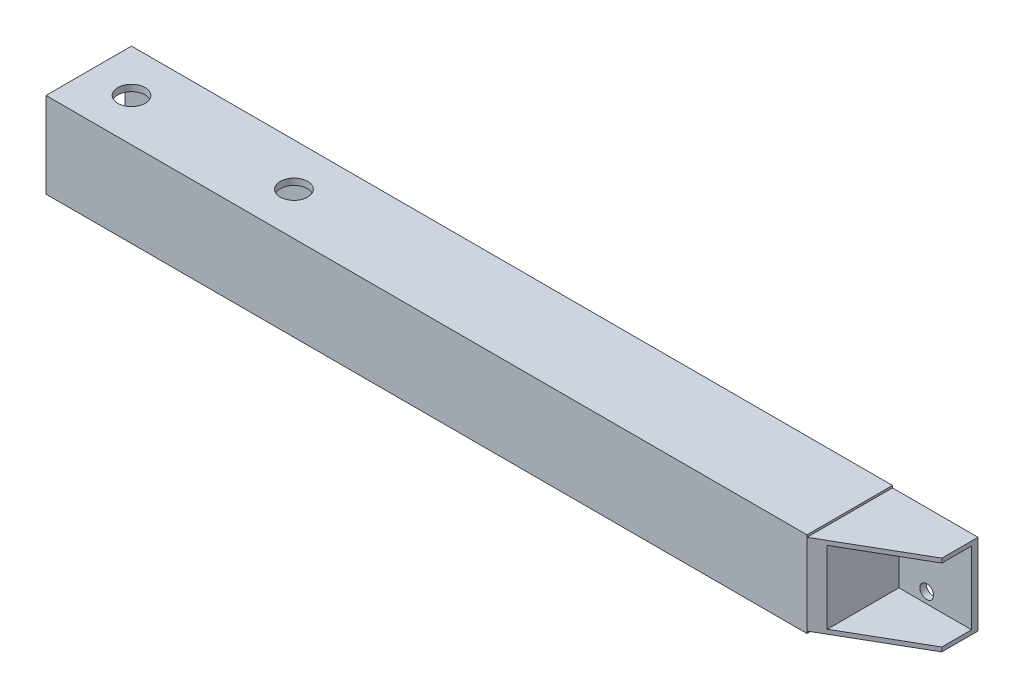
ISO-10303-21;
HEADER;
FILE_DESCRIPTION(('STEP AP214'),'2;1');
FILE_NAME('part.step','',(''),(''),'','','');
FILE_SCHEMA(('AUTOMOTIVE_DESIGN { 1 0 10303 214 1 1 1 1 }'));
ENDSEC;
DATA;
#1=APPLICATION_CONTEXT('core data for automotive mechanical design processes');
#2=APPLICATION_PROTOCOL_DEFINITION('international standard','automotive_design',2000,#1);
#3=PRODUCT_CONTEXT('',#1,'mechanical');
#4=PRODUCT('Part','Part','',(#3));
#5=PRODUCT_RELATED_PRODUCT_CATEGORY('part','',(#4));
#6=PRODUCT_DEFINITION_FORMATION('','',#4);
#7=PRODUCT_DEFINITION_CONTEXT('part definition',#1,'design');
#8=PRODUCT_DEFINITION('design','',#6,#7);
#9=PRODUCT_DEFINITION_SHAPE('','',#8);
#10=(LENGTH_UNIT() NAMED_UNIT(*) SI_UNIT(.MILLI.,.METRE.));
#11=(NAMED_UNIT(*) PLANE_ANGLE_UNIT() SI_UNIT($,.RADIAN.));
#12=(NAMED_UNIT(*) SI_UNIT($,.STERADIAN.) SOLID_ANGLE_UNIT());
#13=UNCERTAINTY_MEASURE_WITH_UNIT(LENGTH_MEASURE(1.E-05),#10,'distance_accuracy_value','');
#14=(GEOMETRIC_REPRESENTATION_CONTEXT(3) GLOBAL_UNCERTAINTY_ASSIGNED_CONTEXT((#13)) GLOBAL_UNIT_ASSIGNED_CONTEXT((#10,
#11,#12)) REPRESENTATION_CONTEXT('',''));
#15=CARTESIAN_POINT('',(0.,0.,0.));
#16=DIRECTION('',(0.,0.,1.));
#17=DIRECTION('',(1.,0.,0.));
#18=AXIS2_PLACEMENT_3D('',#15,#16,#17);
#19=CARTESIAN_POINT('',(0.,0.,0.));
#20=DIRECTION('',(0.,0.,1.));
#21=DIRECTION('',(1.,0.,0.));
#22=AXIS2_PLACEMENT_3D('',#19,#20,#21);
#23=PLANE('',#22);
#24=CARTESIAN_POINT('',(98.5,-6.,0.));
#25=DIRECTION('',(0.,0.,-1.));
#26=DIRECTION('',(1.,0.,0.));
#27=AXIS2_PLACEMENT_3D('',#24,#25,#26);
#28=CIRCLE('',#27,1.60000000000001);
#29=CARTESIAN_POINT('',(100.1,-6.,0.));
#30=VERTEX_POINT('',#29);
#31=EDGE_CURVE('E286',#30,#30,#28,.T.);
#32=ORIENTED_EDGE('',*,*,#31,.F.);
#33=EDGE_LOOP('',(#32));
#34=FACE_BOUND('',#33,.T.);
#35=CARTESIAN_POINT('',(98.5,6.,0.));
#36=DIRECTION('',(0.,0.,-1.));
#37=DIRECTION('',(-1.,0.,0.));
#38=AXIS2_PLACEMENT_3D('',#35,#36,#37);
#39=CIRCLE('',#38,1.60000000000001);
#40=CARTESIAN_POINT('',(96.9,6.,0.));
#41=VERTEX_POINT('',#40);
#42=EDGE_CURVE('E283',#41,#41,#39,.T.);
#43=ORIENTED_EDGE('',*,*,#42,.F.);
#44=EDGE_LOOP('',(#43));
#45=FACE_BOUND('',#44,.T.);
#46=DIRECTION('',(0.,-1.,0.));
#47=VECTOR('',#46,1.);
#48=CARTESIAN_POINT('',(89.,0.,0.));
#49=LINE('',#48,#47);
#50=CARTESIAN_POINT('',(89.,-9.5,0.));
#51=VERTEX_POINT('',#50);
#52=CARTESIAN_POINT('',(89.,-10.,0.));
#53=VERTEX_POINT('',#52);
#54=EDGE_CURVE('E156',#51,#53,#49,.T.);
#55=ORIENTED_EDGE('',*,*,#54,.T.);
#56=DIRECTION('',(1.,0.,0.));
#57=VECTOR('',#56,1.);
#58=CARTESIAN_POINT('',(0.,-10.,0.));
#59=LINE('',#58,#57);
#60=CARTESIAN_POINT('',(-89.,-10.,0.));
#61=VERTEX_POINT('',#60);
#62=EDGE_CURVE('E244',#61,#53,#59,.T.);
#63=ORIENTED_EDGE('',*,*,#62,.F.);
#64=DIRECTION('',(0.,1.,0.));
#65=VECTOR('',#64,1.);
#66=CARTESIAN_POINT('',(-89.,0.,0.));
#67=LINE('',#66,#65);
#68=CARTESIAN_POINT('',(-89.,10.,0.));
#69=VERTEX_POINT('',#68);
#70=EDGE_CURVE('E249',#61,#69,#67,.T.);
#71=ORIENTED_EDGE('',*,*,#70,.T.);
#72=DIRECTION('',(1.,0.,0.));
#73=VECTOR('',#72,1.);
#74=CARTESIAN_POINT('',(0.,10.,0.));
#75=LINE('',#74,#73);
#76=CARTESIAN_POINT('',(89.,10.,0.));
#77=VERTEX_POINT('',#76);
#78=EDGE_CURVE('E258',#69,#77,#75,.T.);
#79=ORIENTED_EDGE('',*,*,#78,.T.);
#80=DIRECTION('',(0.,-1.,0.));
#81=VECTOR('',#80,1.);
#82=CARTESIAN_POINT('',(89.,0.,0.));
#83=LINE('',#82,#81);
#84=CARTESIAN_POINT('',(89.,9.5,0.));
#85=VERTEX_POINT('',#84);
#86=EDGE_CURVE('E173',#77,#85,#83,.T.);
#87=ORIENTED_EDGE('',*,*,#86,.T.);
#88=DIRECTION('',(-1.,0.,0.));
#89=VECTOR('',#88,1.);
#90=CARTESIAN_POINT('',(0.,9.5,0.));
#91=LINE('',#90,#89);
#92=CARTESIAN_POINT('',(109.,9.5,0.));
#93=VERTEX_POINT('',#92);
#94=EDGE_CURVE('E177',#93,#85,#91,.T.);
#95=ORIENTED_EDGE('',*,*,#94,.F.);
#96=DIRECTION('',(0.,-1.,0.));
#97=VECTOR('',#96,1.);
#98=CARTESIAN_POINT('',(109.,0.,0.));
#99=LINE('',#98,#97);
#100=CARTESIAN_POINT('',(109.,-9.5,0.));
#101=VERTEX_POINT('',#100);
#102=EDGE_CURVE('E168',#93,#101,#99,.T.);
#103=ORIENTED_EDGE('',*,*,#102,.T.);
#104=DIRECTION('',(-1.,0.,0.));
#105=VECTOR('',#104,1.);
#106=CARTESIAN_POINT('',(0.,-9.5,0.));
#107=LINE('',#106,#105);
#108=EDGE_CURVE('E152',#101,#51,#107,.T.);
#109=ORIENTED_EDGE('',*,*,#108,.T.);
#110=EDGE_LOOP('',(#55,#63,#71,#79,#87,#95,#103,#109));
#111=FACE_BOUND('',#110,.T.);
#112=ADVANCED_FACE('F34',(#34,#45,#111),#23,.F.);
#113=CARTESIAN_POINT('',(0.,-10.,20.));
#114=DIRECTION('',(0.,1.,0.));
#115=DIRECTION('',(0.,0.,1.));
#116=AXIS2_PLACEMENT_3D('',#113,#114,#115);
#117=PLANE('',#116);
#118=CARTESIAN_POINT('',(-41.,-10.,10.));
#119=DIRECTION('',(0.,-1.,0.));
#120=DIRECTION('',(0.,0.,-1.));
#121=AXIS2_PLACEMENT_3D('',#118,#119,#120);
#122=CIRCLE('',#121,3.2);
#123=CARTESIAN_POINT('',(-41.,-10.,6.8));
#124=VERTEX_POINT('',#123);
#125=EDGE_CURVE('E608',#124,#124,#122,.T.);
#126=ORIENTED_EDGE('',*,*,#125,.F.);
#127=EDGE_LOOP('',(#126));
#128=FACE_BOUND('',#127,.T.);
#129=CARTESIAN_POINT('',(-79.,-10.,10.));
#130=DIRECTION('',(0.,-1.,0.));
#131=DIRECTION('',(0.,0.,-1.));
#132=AXIS2_PLACEMENT_3D('',#129,#130,#131);
#133=CIRCLE('',#132,3.2);
#134=CARTESIAN_POINT('',(-79.,-10.,6.8));
#135=VERTEX_POINT('',#134);
#136=EDGE_CURVE('E290',#135,#135,#133,.T.);
#137=ORIENTED_EDGE('',*,*,#136,.F.);
#138=EDGE_LOOP('',(#137));
#139=FACE_BOUND('',#138,.T.);
#140=DIRECTION('',(0.,0.,-1.));
#141=VECTOR('',#140,1.);
#142=CARTESIAN_POINT('',(89.,-10.,24.));
#143=LINE('',#142,#141);
#144=CARTESIAN_POINT('',(89.,-10.,19.9999999999999));
#145=VERTEX_POINT('',#144);
#146=EDGE_CURVE('E159',#145,#53,#143,.T.);
#147=ORIENTED_EDGE('',*,*,#146,.F.);
#148=DIRECTION('',(1.,0.,0.));
#149=VECTOR('',#148,1.);
#150=CARTESIAN_POINT('',(0.,-10.,20.));
#151=LINE('',#150,#149);
#152=CARTESIAN_POINT('',(-89.,-10.,20.));
#153=VERTEX_POINT('',#152);
#154=EDGE_CURVE('E245',#153,#145,#151,.T.);
#155=ORIENTED_EDGE('',*,*,#154,.F.);
#156=DIRECTION('',(0.,0.,-1.));
#157=VECTOR('',#156,1.);
#158=CARTESIAN_POINT('',(-89.,-10.,20.));
#159=LINE('',#158,#157);
#160=EDGE_CURVE('E255',#153,#61,#159,.T.);
#161=ORIENTED_EDGE('',*,*,#160,.T.);
#162=ORIENTED_EDGE('',*,*,#62,.T.);
#163=EDGE_LOOP('',(#147,#155,#161,#162));
#164=FACE_BOUND('',#163,.T.);
#165=ADVANCED_FACE('F316',(#128,#139,#164),#117,.F.);
#166=CARTESIAN_POINT('',(109.,0.,20.));
#167=DIRECTION('',(1.,0.,0.));
#168=DIRECTION('',(0.,0.,-1.));
#169=AXIS2_PLACEMENT_3D('',#166,#167,#168);
#170=PLANE('',#169);
#171=DIRECTION('',(0.,1.,0.));
#172=VECTOR('',#171,1.);
#173=CARTESIAN_POINT('',(109.,0.,8.45299461620748));
#174=LINE('',#173,#172);
#175=CARTESIAN_POINT('',(109.,-8.5,8.45299461620748));
#176=VERTEX_POINT('',#175);
#177=CARTESIAN_POINT('',(109.,-9.5,8.45299461620748));
#178=VERTEX_POINT('',#177);
#179=EDGE_CURVE('E266',#176,#178,#174,.F.);
#180=ORIENTED_EDGE('',*,*,#179,.T.);
#181=DIRECTION('',(0.,0.,-1.));
#182=VECTOR('',#181,1.);
#183=CARTESIAN_POINT('',(109.,-9.5,24.));
#184=LINE('',#183,#182);
#185=EDGE_CURVE('E51',#178,#101,#184,.T.);
#186=ORIENTED_EDGE('',*,*,#185,.T.);
#187=ORIENTED_EDGE('',*,*,#102,.F.);
#188=DIRECTION('',(0.,0.,-1.));
#189=VECTOR('',#188,1.);
#190=CARTESIAN_POINT('',(109.,9.5,24.));
#191=LINE('',#190,#189);
#192=CARTESIAN_POINT('',(109.,9.5,8.45299461620748));
#193=VERTEX_POINT('',#192);
#194=EDGE_CURVE('E184',#193,#93,#191,.T.);
#195=ORIENTED_EDGE('',*,*,#194,.F.);
#196=DIRECTION('',(0.,-1.,0.));
#197=VECTOR('',#196,1.);
#198=CARTESIAN_POINT('',(109.,0.,8.45299461620748));
#199=LINE('',#198,#197);
#200=CARTESIAN_POINT('',(109.,8.5,8.45299461620748));
#201=VERTEX_POINT('',#200);
#202=EDGE_CURVE('E269',#193,#201,#199,.T.);
#203=ORIENTED_EDGE('',*,*,#202,.T.);
#204=DIRECTION('',(0.,0.,1.));
#205=VECTOR('',#204,1.);
#206=CARTESIAN_POINT('',(109.,8.5,1.5));
#207=LINE('',#206,#205);
#208=CARTESIAN_POINT('',(109.,8.5,1.5));
#209=VERTEX_POINT('',#208);
#210=EDGE_CURVE('E199',#209,#201,#207,.T.);
#211=ORIENTED_EDGE('',*,*,#210,.F.);
#212=DIRECTION('',(0.,1.,0.));
#213=VECTOR('',#212,1.);
#214=CARTESIAN_POINT('',(109.,8.5,1.5));
#215=LINE('',#214,#213);
#216=CARTESIAN_POINT('',(109.,-8.5,1.5));
#217=VERTEX_POINT('',#216);
#218=EDGE_CURVE('E183',#217,#209,#215,.T.);
#219=ORIENTED_EDGE('',*,*,#218,.F.);
#220=DIRECTION('',(0.,0.,1.));
#221=VECTOR('',#220,1.);
#222=CARTESIAN_POINT('',(109.,-8.5,1.5));
#223=LINE('',#222,#221);
#224=EDGE_CURVE('E200',#217,#176,#223,.T.);
#225=ORIENTED_EDGE('',*,*,#224,.T.);
#226=EDGE_LOOP('',(#180,#186,#187,#195,#203,#211,#219,#225));
#227=FACE_BOUND('',#226,.T.);
#228=ADVANCED_FACE('F322',(#227),#170,.T.);
#229=CARTESIAN_POINT('',(109.,0.,8.45299461620748));
#230=DIRECTION('',(-0.499999999999998,0.,-0.86602540378444));
#231=DIRECTION('',(0.,-1.,0.));
#232=AXIS2_PLACEMENT_3D('',#229,#230,#231);
#233=PLANE('',#232);
#234=DIRECTION('',(0.,1.,0.));
#235=VECTOR('',#234,1.);
#236=CARTESIAN_POINT('',(88.9999999999999,0.,20.));
#237=LINE('',#236,#235);
#238=CARTESIAN_POINT('',(89.,-9.5,19.9999999999999));
#239=VERTEX_POINT('',#238);
#240=CARTESIAN_POINT('',(88.9999999999999,9.5,20.));
#241=VERTEX_POINT('',#240);
#242=EDGE_CURVE('E58',#239,#241,#237,.T.);
#243=ORIENTED_EDGE('',*,*,#242,.F.);
#244=DIRECTION('',(-0.86602540378444,0.,0.499999999999998));
#245=VECTOR('',#244,1.);
#246=CARTESIAN_POINT('',(109.,-9.5,8.45299461620748));
#247=LINE('',#246,#245);
#248=EDGE_CURVE('E11',#239,#178,#247,.F.);
#249=ORIENTED_EDGE('',*,*,#248,.T.);
#250=ORIENTED_EDGE('',*,*,#179,.F.);
#251=DIRECTION('',(-0.86602540378444,0.,0.499999999999998));
#252=VECTOR('',#251,1.);
#253=CARTESIAN_POINT('',(109.,-8.5,8.45299461620748));
#254=LINE('',#253,#252);
#255=CARTESIAN_POINT('',(92.,-8.5,18.2679491924311));
#256=VERTEX_POINT('',#255);
#257=EDGE_CURVE('E275',#256,#176,#254,.F.);
#258=ORIENTED_EDGE('',*,*,#257,.F.);
#259=DIRECTION('',(0.,1.,0.));
#260=VECTOR('',#259,1.);
#261=CARTESIAN_POINT('',(92.,0.,18.2679491924311));
#262=LINE('',#261,#260);
#263=CARTESIAN_POINT('',(92.,8.5,18.2679491924311));
#264=VERTEX_POINT('',#263);
#265=EDGE_CURVE('E273',#264,#256,#262,.F.);
#266=ORIENTED_EDGE('',*,*,#265,.F.);
#267=DIRECTION('',(0.86602540378444,0.,-0.499999999999998));
#268=VECTOR('',#267,1.);
#269=CARTESIAN_POINT('',(109.,8.5,8.45299461620748));
#270=LINE('',#269,#268);
#271=EDGE_CURVE('E271',#201,#264,#270,.F.);
#272=ORIENTED_EDGE('',*,*,#271,.F.);
#273=ORIENTED_EDGE('',*,*,#202,.F.);
#274=DIRECTION('',(-0.86602540378444,0.,0.499999999999998));
#275=VECTOR('',#274,1.);
#276=CARTESIAN_POINT('',(109.,9.5,8.45299461620748));
#277=LINE('',#276,#275);
#278=EDGE_CURVE('E43',#241,#193,#277,.F.);
#279=ORIENTED_EDGE('',*,*,#278,.F.);
#280=EDGE_LOOP('',(#243,#249,#250,#258,#266,#272,#273,#279));
#281=FACE_BOUND('',#280,.T.);
#282=ADVANCED_FACE('F36',(#281),#233,.F.);
#283=CARTESIAN_POINT('',(0.,10.,20.));
#284=DIRECTION('',(0.,1.,0.));
#285=DIRECTION('',(0.,0.,1.));
#286=AXIS2_PLACEMENT_3D('',#283,#284,#285);
#287=PLANE('',#286);
#288=CARTESIAN_POINT('',(-41.,10.,10.));
#289=DIRECTION('',(0.,1.,0.));
#290=DIRECTION('',(0.,0.,1.));
#291=AXIS2_PLACEMENT_3D('',#288,#289,#290);
#292=CIRCLE('',#291,3.2);
#293=CARTESIAN_POINT('',(-41.,10.,13.2));
#294=VERTEX_POINT('',#293);
#295=EDGE_CURVE('E297',#294,#294,#292,.T.);
#296=ORIENTED_EDGE('',*,*,#295,.F.);
#297=EDGE_LOOP('',(#296));
#298=FACE_BOUND('',#297,.T.);
#299=CARTESIAN_POINT('',(-79.,10.,10.));
#300=DIRECTION('',(0.,1.,0.));
#301=DIRECTION('',(0.,0.,1.));
#302=AXIS2_PLACEMENT_3D('',#299,#300,#301);
#303=CIRCLE('',#302,3.2);
#304=CARTESIAN_POINT('',(-79.,10.,13.2));
#305=VERTEX_POINT('',#304);
#306=EDGE_CURVE('E294',#305,#305,#303,.T.);
#307=ORIENTED_EDGE('',*,*,#306,.F.);
#308=EDGE_LOOP('',(#307));
#309=FACE_BOUND('',#308,.T.);
#310=DIRECTION('',(1.,0.,0.));
#311=VECTOR('',#310,1.);
#312=CARTESIAN_POINT('',(0.,10.,20.));
#313=LINE('',#312,#311);
#314=CARTESIAN_POINT('',(-89.,10.,20.));
#315=VERTEX_POINT('',#314);
#316=CARTESIAN_POINT('',(89.,10.,19.9999999999999));
#317=VERTEX_POINT('',#316);
#318=EDGE_CURVE('E248',#315,#317,#313,.T.);
#319=ORIENTED_EDGE('',*,*,#318,.T.);
#320=DIRECTION('',(0.,0.,-1.));
#321=VECTOR('',#320,1.);
#322=CARTESIAN_POINT('',(89.,10.,24.));
#323=LINE('',#322,#321);
#324=EDGE_CURVE('E180',#317,#77,#323,.T.);
#325=ORIENTED_EDGE('',*,*,#324,.T.);
#326=ORIENTED_EDGE('',*,*,#78,.F.);
#327=DIRECTION('',(0.,0.,-1.));
#328=VECTOR('',#327,1.);
#329=CARTESIAN_POINT('',(-89.,10.,20.));
#330=LINE('',#329,#328);
#331=EDGE_CURVE('E264',#315,#69,#330,.T.);
#332=ORIENTED_EDGE('',*,*,#331,.F.);
#333=EDGE_LOOP('',(#319,#325,#326,#332));
#334=FACE_BOUND('',#333,.T.);
#335=ADVANCED_FACE('F332',(#298,#309,#334),#287,.T.);
#336=CARTESIAN_POINT('',(-89.,0.,20.));
#337=DIRECTION('',(-1.,0.,0.));
#338=DIRECTION('',(0.,0.,1.));
#339=AXIS2_PLACEMENT_3D('',#336,#337,#338);
#340=PLANE('',#339);
#341=ORIENTED_EDGE('',*,*,#70,.F.);
#342=ORIENTED_EDGE('',*,*,#160,.F.);
#343=DIRECTION('',(0.,1.,0.));
#344=VECTOR('',#343,1.);
#345=CARTESIAN_POINT('',(-89.,0.,20.));
#346=LINE('',#345,#344);
#347=EDGE_CURVE('E252',#153,#315,#346,.T.);
#348=ORIENTED_EDGE('',*,*,#347,.T.);
#349=ORIENTED_EDGE('',*,*,#331,.T.);
#350=EDGE_LOOP('',(#341,#342,#348,#349));
#351=FACE_BOUND('',#350,.T.);
#352=DIRECTION('',(0.,0.,1.));
#353=VECTOR('',#352,1.);
#354=CARTESIAN_POINT('',(-89.,-8.49999999999991,1.49999999999998));
#355=LINE('',#354,#353);
#356=CARTESIAN_POINT('',(-89.,-8.49999999999991,1.49999999999998));
#357=VERTEX_POINT('',#356);
#358=CARTESIAN_POINT('',(-89.,-8.49999999999991,18.5));
#359=VERTEX_POINT('',#358);
#360=EDGE_CURVE('E216',#357,#359,#355,.T.);
#361=ORIENTED_EDGE('',*,*,#360,.F.);
#362=DIRECTION('',(0.,1.,0.));
#363=VECTOR('',#362,1.);
#364=CARTESIAN_POINT('',(-89.,-8.49999999999991,1.49999999999998));
#365=LINE('',#364,#363);
#366=CARTESIAN_POINT('',(-89.,8.49999999999995,1.49999999999998));
#367=VERTEX_POINT('',#366);
#368=EDGE_CURVE('E203',#357,#367,#365,.T.);
#369=ORIENTED_EDGE('',*,*,#368,.T.);
#370=DIRECTION('',(0.,0.,1.));
#371=VECTOR('',#370,1.);
#372=CARTESIAN_POINT('',(-89.,8.49999999999995,1.49999999999998));
#373=LINE('',#372,#371);
#374=CARTESIAN_POINT('',(-89.,8.49999999999995,18.5));
#375=VERTEX_POINT('',#374);
#376=EDGE_CURVE('E227',#367,#375,#373,.T.);
#377=ORIENTED_EDGE('',*,*,#376,.T.);
#378=DIRECTION('',(0.,1.,0.));
#379=VECTOR('',#378,1.);
#380=CARTESIAN_POINT('',(-89.,-8.49999999999991,18.5));
#381=LINE('',#380,#379);
#382=EDGE_CURVE('E230',#359,#375,#381,.T.);
#383=ORIENTED_EDGE('',*,*,#382,.F.);
#384=EDGE_LOOP('',(#361,#369,#377,#383));
#385=FACE_BOUND('',#384,.T.);
#386=ADVANCED_FACE('F329',(#351,#385),#340,.T.);
#387=CARTESIAN_POINT('',(0.,0.,20.));
#388=DIRECTION('',(0.,0.,1.));
#389=DIRECTION('',(1.,0.,0.));
#390=AXIS2_PLACEMENT_3D('',#387,#388,#389);
#391=PLANE('',#390);
#392=ORIENTED_EDGE('',*,*,#154,.T.);
#393=EDGE_CURVE('E278',#145,#239,#237,.T.);
#394=ORIENTED_EDGE('',*,*,#393,.T.);
#395=ORIENTED_EDGE('',*,*,#242,.T.);
#396=EDGE_CURVE('E277',#241,#317,#237,.T.);
#397=ORIENTED_EDGE('',*,*,#396,.T.);
#398=ORIENTED_EDGE('',*,*,#318,.F.);
#399=ORIENTED_EDGE('',*,*,#347,.F.);
#400=EDGE_LOOP('',(#392,#394,#395,#397,#398,#399));
#401=FACE_BOUND('',#400,.T.);
#402=ADVANCED_FACE('F327',(#401),#391,.T.);
#403=CARTESIAN_POINT('',(89.,-8.49999999999991,1.49999999999998));
#404=DIRECTION('',(0.,0.,1.));
#405=DIRECTION('',(0.,-1.,0.));
#406=AXIS2_PLACEMENT_3D('',#403,#404,#405);
#407=PLANE('',#406);
#408=ORIENTED_EDGE('',*,*,#368,.F.);
#409=DIRECTION('',(-1.,0.,0.));
#410=VECTOR('',#409,1.);
#411=CARTESIAN_POINT('',(89.,-8.49999999999991,1.49999999999998));
#412=LINE('',#411,#410);
#413=CARTESIAN_POINT('',(89.,-8.49999999999991,1.49999999999998));
#414=VERTEX_POINT('',#413);
#415=EDGE_CURVE('E224',#414,#357,#412,.T.);
#416=ORIENTED_EDGE('',*,*,#415,.F.);
#417=DIRECTION('',(0.,1.,0.));
#418=VECTOR('',#417,1.);
#419=CARTESIAN_POINT('',(89.,-8.49999999999991,1.49999999999998));
#420=LINE('',#419,#418);
#421=CARTESIAN_POINT('',(89.,8.49999999999995,1.49999999999998));
#422=VERTEX_POINT('',#421);
#423=EDGE_CURVE('E212',#414,#422,#420,.T.);
#424=ORIENTED_EDGE('',*,*,#423,.T.);
#425=DIRECTION('',(-1.,0.,0.));
#426=VECTOR('',#425,1.);
#427=CARTESIAN_POINT('',(89.,8.49999999999995,1.49999999999998));
#428=LINE('',#427,#426);
#429=EDGE_CURVE('E241',#422,#367,#428,.T.);
#430=ORIENTED_EDGE('',*,*,#429,.T.);
#431=EDGE_LOOP('',(#408,#416,#424,#430));
#432=FACE_BOUND('',#431,.T.);
#433=ADVANCED_FACE('F399',(#432),#407,.T.);
#434=CARTESIAN_POINT('',(89.,8.49999999999995,1.49999999999998));
#435=DIRECTION('',(0.,-1.,0.));
#436=DIRECTION('',(0.,0.,-1.));
#437=AXIS2_PLACEMENT_3D('',#434,#435,#436);
#438=PLANE('',#437);
#439=CARTESIAN_POINT('',(-41.,8.49999999999995,10.));
#440=DIRECTION('',(0.,-1.,0.));
#441=DIRECTION('',(0.,0.,-1.));
#442=AXIS2_PLACEMENT_3D('',#439,#440,#441);
#443=CIRCLE('',#442,3.2);
#444=CARTESIAN_POINT('',(-41.,8.49999999999995,6.8));
#445=VERTEX_POINT('',#444);
#446=EDGE_CURVE('E302',#445,#445,#443,.T.);
#447=ORIENTED_EDGE('',*,*,#446,.F.);
#448=EDGE_LOOP('',(#447));
#449=FACE_BOUND('',#448,.T.);
#450=CARTESIAN_POINT('',(-79.,8.49999999999995,10.));
#451=DIRECTION('',(0.,-1.,0.));
#452=DIRECTION('',(0.,0.,-1.));
#453=AXIS2_PLACEMENT_3D('',#450,#451,#452);
#454=CIRCLE('',#453,3.2);
#455=CARTESIAN_POINT('',(-79.,8.49999999999995,6.8));
#456=VERTEX_POINT('',#455);
#457=EDGE_CURVE('E289',#456,#456,#454,.T.);
#458=ORIENTED_EDGE('',*,*,#457,.F.);
#459=EDGE_LOOP('',(#458));
#460=FACE_BOUND('',#459,.T.);
#461=ORIENTED_EDGE('',*,*,#376,.F.);
#462=ORIENTED_EDGE('',*,*,#429,.F.);
#463=DIRECTION('',(0.,0.,1.));
#464=VECTOR('',#463,1.);
#465=CARTESIAN_POINT('',(89.,8.49999999999995,1.49999999999998));
#466=LINE('',#465,#464);
#467=CARTESIAN_POINT('',(89.,8.49999999999995,18.5));
#468=VERTEX_POINT('',#467);
#469=EDGE_CURVE('E215',#422,#468,#466,.T.);
#470=ORIENTED_EDGE('',*,*,#469,.T.);
#471=DIRECTION('',(-1.,0.,0.));
#472=VECTOR('',#471,1.);
#473=CARTESIAN_POINT('',(89.,8.49999999999995,18.5));
#474=LINE('',#473,#472);
#475=EDGE_CURVE('E239',#468,#375,#474,.T.);
#476=ORIENTED_EDGE('',*,*,#475,.T.);
#477=EDGE_LOOP('',(#461,#462,#470,#476));
#478=FACE_BOUND('',#477,.T.);
#479=ADVANCED_FACE('F396',(#449,#460,#478),#438,.T.);
#480=CARTESIAN_POINT('',(89.,-8.49999999999991,18.5));
#481=DIRECTION('',(0.,0.,1.));
#482=DIRECTION('',(1.,0.,0.));
#483=AXIS2_PLACEMENT_3D('',#480,#481,#482);
#484=PLANE('',#483);
#485=ORIENTED_EDGE('',*,*,#382,.T.);
#486=ORIENTED_EDGE('',*,*,#475,.F.);
#487=DIRECTION('',(0.,1.,0.));
#488=VECTOR('',#487,1.);
#489=CARTESIAN_POINT('',(89.,-8.49999999999991,18.5));
#490=LINE('',#489,#488);
#491=CARTESIAN_POINT('',(89.,-8.49999999999991,18.5));
#492=VERTEX_POINT('',#491);
#493=EDGE_CURVE('E218',#492,#468,#490,.T.);
#494=ORIENTED_EDGE('',*,*,#493,.F.);
#495=DIRECTION('',(-1.,0.,0.));
#496=VECTOR('',#495,1.);
#497=CARTESIAN_POINT('',(89.,-8.49999999999991,18.5));
#498=LINE('',#497,#496);
#499=EDGE_CURVE('E237',#492,#359,#498,.T.);
#500=ORIENTED_EDGE('',*,*,#499,.T.);
#501=EDGE_LOOP('',(#485,#486,#494,#500));
#502=FACE_BOUND('',#501,.T.);
#503=ADVANCED_FACE('F392',(#502),#484,.F.);
#504=CARTESIAN_POINT('',(89.,-8.49999999999991,1.49999999999998));
#505=DIRECTION('',(0.,-1.,0.));
#506=DIRECTION('',(0.,0.,-1.));
#507=AXIS2_PLACEMENT_3D('',#504,#505,#506);
#508=PLANE('',#507);
#509=CARTESIAN_POINT('',(-41.,-8.49999999999991,10.));
#510=DIRECTION('',(0.,-1.,0.));
#511=DIRECTION('',(0.,0.,-1.));
#512=AXIS2_PLACEMENT_3D('',#509,#510,#511);
#513=CIRCLE('',#512,3.2);
#514=CARTESIAN_POINT('',(-41.,-8.49999999999991,6.8));
#515=VERTEX_POINT('',#514);
#516=EDGE_CURVE('E38',#515,#515,#513,.T.);
#517=ORIENTED_EDGE('',*,*,#516,.T.);
#518=EDGE_LOOP('',(#517));
#519=FACE_BOUND('',#518,.T.);
#520=CARTESIAN_POINT('',(-79.,-8.49999999999991,10.));
#521=DIRECTION('',(0.,-1.,0.));
#522=DIRECTION('',(0.,0.,-1.));
#523=AXIS2_PLACEMENT_3D('',#520,#521,#522);
#524=CIRCLE('',#523,3.2);
#525=CARTESIAN_POINT('',(-79.,-8.49999999999991,6.8));
#526=VERTEX_POINT('',#525);
#527=EDGE_CURVE('E287',#526,#526,#524,.T.);
#528=ORIENTED_EDGE('',*,*,#527,.T.);
#529=EDGE_LOOP('',(#528));
#530=FACE_BOUND('',#529,.T.);
#531=ORIENTED_EDGE('',*,*,#360,.T.);
#532=ORIENTED_EDGE('',*,*,#499,.F.);
#533=DIRECTION('',(0.,0.,1.));
#534=VECTOR('',#533,1.);
#535=CARTESIAN_POINT('',(89.,-8.49999999999991,1.49999999999998));
#536=LINE('',#535,#534);
#537=EDGE_CURVE('E221',#414,#492,#536,.T.);
#538=ORIENTED_EDGE('',*,*,#537,.F.);
#539=ORIENTED_EDGE('',*,*,#415,.T.);
#540=EDGE_LOOP('',(#531,#532,#538,#539));
#541=FACE_BOUND('',#540,.T.);
#542=ADVANCED_FACE('F388',(#519,#530,#541),#508,.F.);
#543=CARTESIAN_POINT('',(89.,0.,0.));
#544=DIRECTION('',(1.,0.,0.));
#545=DIRECTION('',(0.,0.,-1.));
#546=AXIS2_PLACEMENT_3D('',#543,#544,#545);
#547=PLANE('',#546);
#548=ORIENTED_EDGE('',*,*,#423,.F.);
#549=ORIENTED_EDGE('',*,*,#537,.T.);
#550=ORIENTED_EDGE('',*,*,#493,.T.);
#551=ORIENTED_EDGE('',*,*,#469,.F.);
#552=EDGE_LOOP('',(#548,#549,#550,#551));
#553=FACE_BOUND('',#552,.T.);
#554=ADVANCED_FACE('F382',(#553),#547,.F.);
#555=CARTESIAN_POINT('',(109.,-8.5,1.5));
#556=DIRECTION('',(0.,-1.,0.));
#557=DIRECTION('',(1.,0.,0.));
#558=AXIS2_PLACEMENT_3D('',#555,#556,#557);
#559=PLANE('',#558);
#560=DIRECTION('',(0.,0.,1.));
#561=VECTOR('',#560,1.);
#562=CARTESIAN_POINT('',(92.,-8.5,1.5));
#563=LINE('',#562,#561);
#564=CARTESIAN_POINT('',(92.,-8.5,1.5));
#565=VERTEX_POINT('',#564);
#566=EDGE_CURVE('E204',#565,#256,#563,.T.);
#567=ORIENTED_EDGE('',*,*,#566,.T.);
#568=ORIENTED_EDGE('',*,*,#257,.T.);
#569=ORIENTED_EDGE('',*,*,#224,.F.);
#570=DIRECTION('',(1.,0.,0.));
#571=VECTOR('',#570,1.);
#572=CARTESIAN_POINT('',(109.,-8.5,1.5));
#573=LINE('',#572,#571);
#574=EDGE_CURVE('E196',#565,#217,#573,.T.);
#575=ORIENTED_EDGE('',*,*,#574,.F.);
#576=EDGE_LOOP('',(#567,#568,#569,#575));
#577=FACE_BOUND('',#576,.T.);
#578=ADVANCED_FACE('F372',(#577),#559,.F.);
#579=CARTESIAN_POINT('',(92.,8.5,1.5));
#580=DIRECTION('',(-1.,0.,0.));
#581=DIRECTION('',(0.,0.,1.));
#582=AXIS2_PLACEMENT_3D('',#579,#580,#581);
#583=PLANE('',#582);
#584=DIRECTION('',(0.,0.,1.));
#585=VECTOR('',#584,1.);
#586=CARTESIAN_POINT('',(92.,8.5,1.5));
#587=LINE('',#586,#585);
#588=CARTESIAN_POINT('',(92.,8.5,1.5));
#589=VERTEX_POINT('',#588);
#590=EDGE_CURVE('E207',#589,#264,#587,.T.);
#591=ORIENTED_EDGE('',*,*,#590,.T.);
#592=ORIENTED_EDGE('',*,*,#265,.T.);
#593=ORIENTED_EDGE('',*,*,#566,.F.);
#594=DIRECTION('',(0.,-1.,0.));
#595=VECTOR('',#594,1.);
#596=CARTESIAN_POINT('',(92.,8.5,1.5));
#597=LINE('',#596,#595);
#598=EDGE_CURVE('E193',#589,#565,#597,.T.);
#599=ORIENTED_EDGE('',*,*,#598,.F.);
#600=EDGE_LOOP('',(#591,#592,#593,#599));
#601=FACE_BOUND('',#600,.T.);
#602=ADVANCED_FACE('F374',(#601),#583,.F.);
#603=CARTESIAN_POINT('',(109.,8.5,1.5));
#604=DIRECTION('',(0.,1.,0.));
#605=DIRECTION('',(0.,0.,1.));
#606=AXIS2_PLACEMENT_3D('',#603,#604,#605);
#607=PLANE('',#606);
#608=ORIENTED_EDGE('',*,*,#210,.T.);
#609=ORIENTED_EDGE('',*,*,#271,.T.);
#610=ORIENTED_EDGE('',*,*,#590,.F.);
#611=DIRECTION('',(-1.,0.,0.));
#612=VECTOR('',#611,1.);
#613=CARTESIAN_POINT('',(109.,8.5,1.5));
#614=LINE('',#613,#612);
#615=EDGE_CURVE('E190',#209,#589,#614,.T.);
#616=ORIENTED_EDGE('',*,*,#615,.F.);
#617=EDGE_LOOP('',(#608,#609,#610,#616));
#618=FACE_BOUND('',#617,.T.);
#619=ADVANCED_FACE('F366',(#618),#607,.F.);
#620=CARTESIAN_POINT('',(0.,0.,1.5));
#621=DIRECTION('',(0.,0.,-1.));
#622=DIRECTION('',(-1.,0.,0.));
#623=AXIS2_PLACEMENT_3D('',#620,#621,#622);
#624=PLANE('',#623);
#625=CARTESIAN_POINT('',(98.5,-6.,1.5));
#626=DIRECTION('',(0.,0.,-1.));
#627=DIRECTION('',(-1.,0.,0.));
#628=AXIS2_PLACEMENT_3D('',#625,#626,#627);
#629=CIRCLE('',#628,1.60000000000001);
#630=CARTESIAN_POINT('',(96.9,-6.,1.5));
#631=VERTEX_POINT('',#630);
#632=EDGE_CURVE('E284',#631,#631,#629,.T.);
#633=ORIENTED_EDGE('',*,*,#632,.T.);
#634=EDGE_LOOP('',(#633));
#635=FACE_BOUND('',#634,.T.);
#636=CARTESIAN_POINT('',(98.5,6.,1.5));
#637=DIRECTION('',(0.,0.,-1.));
#638=DIRECTION('',(-1.,0.,0.));
#639=AXIS2_PLACEMENT_3D('',#636,#637,#638);
#640=CIRCLE('',#639,1.60000000000001);
#641=CARTESIAN_POINT('',(96.9,6.,1.5));
#642=VERTEX_POINT('',#641);
#643=EDGE_CURVE('E163',#642,#642,#640,.T.);
#644=ORIENTED_EDGE('',*,*,#643,.T.);
#645=EDGE_LOOP('',(#644));
#646=FACE_BOUND('',#645,.T.);
#647=ORIENTED_EDGE('',*,*,#218,.T.);
#648=ORIENTED_EDGE('',*,*,#615,.T.);
#649=ORIENTED_EDGE('',*,*,#598,.T.);
#650=ORIENTED_EDGE('',*,*,#574,.T.);
#651=EDGE_LOOP('',(#647,#648,#649,#650));
#652=FACE_BOUND('',#651,.T.);
#653=ADVANCED_FACE('F368',(#635,#646,#652),#624,.F.);
#654=CARTESIAN_POINT('',(89.,0.,24.));
#655=DIRECTION('',(1.,0.,0.));
#656=DIRECTION('',(0.,0.,-1.));
#657=AXIS2_PLACEMENT_3D('',#654,#655,#656);
#658=PLANE('',#657);
#659=DIRECTION('',(0.,0.,-1.));
#660=VECTOR('',#659,1.);
#661=CARTESIAN_POINT('',(89.,9.5,24.));
#662=LINE('',#661,#660);
#663=EDGE_CURVE('E181',#241,#85,#662,.T.);
#664=ORIENTED_EDGE('',*,*,#663,.T.);
#665=ORIENTED_EDGE('',*,*,#86,.F.);
#666=ORIENTED_EDGE('',*,*,#324,.F.);
#667=ORIENTED_EDGE('',*,*,#396,.F.);
#668=EDGE_LOOP('',(#664,#665,#666,#667));
#669=FACE_BOUND('',#668,.T.);
#670=ADVANCED_FACE('F358',(#669),#658,.T.);
#671=CARTESIAN_POINT('',(0.,9.5,24.));
#672=DIRECTION('',(0.,-1.,0.));
#673=DIRECTION('',(0.,0.,-1.));
#674=AXIS2_PLACEMENT_3D('',#671,#672,#673);
#675=PLANE('',#674);
#676=ORIENTED_EDGE('',*,*,#278,.T.);
#677=ORIENTED_EDGE('',*,*,#194,.T.);
#678=ORIENTED_EDGE('',*,*,#94,.T.);
#679=ORIENTED_EDGE('',*,*,#663,.F.);
#680=EDGE_LOOP('',(#676,#677,#678,#679));
#681=FACE_BOUND('',#680,.T.);
#682=ADVANCED_FACE('F361',(#681),#675,.F.);
#683=CARTESIAN_POINT('',(89.,0.,24.));
#684=DIRECTION('',(1.,0.,0.));
#685=DIRECTION('',(0.,0.,-1.));
#686=AXIS2_PLACEMENT_3D('',#683,#684,#685);
#687=PLANE('',#686);
#688=ORIENTED_EDGE('',*,*,#146,.T.);
#689=ORIENTED_EDGE('',*,*,#54,.F.);
#690=DIRECTION('',(0.,0.,-1.));
#691=VECTOR('',#690,1.);
#692=CARTESIAN_POINT('',(89.,-9.5,24.));
#693=LINE('',#692,#691);
#694=EDGE_CURVE('E148',#239,#51,#693,.T.);
#695=ORIENTED_EDGE('',*,*,#694,.F.);
#696=ORIENTED_EDGE('',*,*,#393,.F.);
#697=EDGE_LOOP('',(#688,#689,#695,#696));
#698=FACE_BOUND('',#697,.T.);
#699=ADVANCED_FACE('F157',(#698),#687,.T.);
#700=CARTESIAN_POINT('',(0.,-9.5,24.));
#701=DIRECTION('',(0.,-1.,0.));
#702=DIRECTION('',(0.,0.,-1.));
#703=AXIS2_PLACEMENT_3D('',#700,#701,#702);
#704=PLANE('',#703);
#705=ORIENTED_EDGE('',*,*,#694,.T.);
#706=ORIENTED_EDGE('',*,*,#108,.F.);
#707=ORIENTED_EDGE('',*,*,#185,.F.);
#708=ORIENTED_EDGE('',*,*,#248,.F.);
#709=EDGE_LOOP('',(#705,#706,#707,#708));
#710=FACE_BOUND('',#709,.T.);
#711=ADVANCED_FACE('F150',(#710),#704,.T.);
#712=CARTESIAN_POINT('',(98.5,6.,24.));
#713=DIRECTION('',(0.,0.,-1.));
#714=DIRECTION('',(-1.,0.,0.));
#715=AXIS2_PLACEMENT_3D('',#712,#713,#714);
#716=CYLINDRICAL_SURFACE('',#715,1.60000000000001);
#717=ORIENTED_EDGE('',*,*,#42,.T.);
#718=EDGE_LOOP('',(#717));
#719=FACE_BOUND('',#718,.T.);
#720=ORIENTED_EDGE('',*,*,#643,.F.);
#721=EDGE_LOOP('',(#720));
#722=FACE_BOUND('',#721,.T.);
#723=ADVANCED_FACE('F312',(#719,#722),#716,.F.);
#724=CARTESIAN_POINT('',(98.5,-6.,24.));
#725=DIRECTION('',(0.,0.,-1.));
#726=DIRECTION('',(-1.,0.,0.));
#727=AXIS2_PLACEMENT_3D('',#724,#725,#726);
#728=CYLINDRICAL_SURFACE('',#727,1.60000000000001);
#729=ORIENTED_EDGE('',*,*,#31,.T.);
#730=EDGE_LOOP('',(#729));
#731=FACE_BOUND('',#730,.T.);
#732=ORIENTED_EDGE('',*,*,#632,.F.);
#733=EDGE_LOOP('',(#732));
#734=FACE_BOUND('',#733,.T.);
#735=ADVANCED_FACE('F495',(#731,#734),#728,.F.);
#736=CARTESIAN_POINT('',(-79.,24.,10.));
#737=DIRECTION('',(0.,-1.,0.));
#738=DIRECTION('',(0.,0.,-1.));
#739=AXIS2_PLACEMENT_3D('',#736,#737,#738);
#740=CYLINDRICAL_SURFACE('',#739,3.2);
#741=ORIENTED_EDGE('',*,*,#136,.T.);
#742=EDGE_LOOP('',(#741));
#743=FACE_BOUND('',#742,.T.);
#744=ORIENTED_EDGE('',*,*,#527,.F.);
#745=EDGE_LOOP('',(#744));
#746=FACE_BOUND('',#745,.T.);
#747=ADVANCED_FACE('F489',(#743,#746),#740,.F.);
#748=ORIENTED_EDGE('',*,*,#306,.T.);
#749=EDGE_LOOP('',(#748));
#750=FACE_BOUND('',#749,.T.);
#751=ORIENTED_EDGE('',*,*,#457,.T.);
#752=EDGE_LOOP('',(#751));
#753=FACE_BOUND('',#752,.T.);
#754=ADVANCED_FACE('F494',(#750,#753),#740,.F.);
#755=CARTESIAN_POINT('',(-41.,24.,10.));
#756=DIRECTION('',(0.,-1.,0.));
#757=DIRECTION('',(0.,0.,-1.));
#758=AXIS2_PLACEMENT_3D('',#755,#756,#757);
#759=CYLINDRICAL_SURFACE('',#758,3.2);
#760=ORIENTED_EDGE('',*,*,#125,.T.);
#761=EDGE_LOOP('',(#760));
#762=FACE_BOUND('',#761,.T.);
#763=ORIENTED_EDGE('',*,*,#516,.F.);
#764=EDGE_LOOP('',(#763));
#765=FACE_BOUND('',#764,.T.);
#766=ADVANCED_FACE('F506',(#762,#765),#759,.F.);
#767=ORIENTED_EDGE('',*,*,#295,.T.);
#768=EDGE_LOOP('',(#767));
#769=FACE_BOUND('',#768,.T.);
#770=ORIENTED_EDGE('',*,*,#446,.T.);
#771=EDGE_LOOP('',(#770));
#772=FACE_BOUND('',#771,.T.);
#773=ADVANCED_FACE('F515',(#769,#772),#759,.F.);
#774=CLOSED_SHELL('',(#112,#165,#228,#282,#335,#386,#402,#433,#479,#503,#542,#554,#578,#602,
#619,#653,#670,#682,#699,#711,#723,#735,#747,#754,#766,#773));
#775=MANIFOLD_SOLID_BREP('B2',#774);
#776=ADVANCED_BREP_SHAPE_REPRESENTATION('',(#18,#775),#14);
#777=SHAPE_DEFINITION_REPRESENTATION(#9,#776);
ENDSEC;
END-ISO-10303-21;
